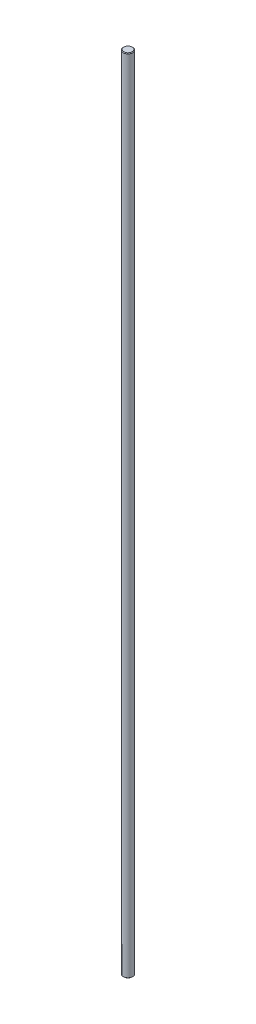
ISO-10303-21;
HEADER;
FILE_DESCRIPTION(('STEP AP214'),'2;1');
FILE_NAME('part.step','',(''),(''),'','','');
FILE_SCHEMA(('AUTOMOTIVE_DESIGN { 1 0 10303 214 1 1 1 1 }'));
ENDSEC;
DATA;
#1=APPLICATION_CONTEXT('core data for automotive mechanical design processes');
#2=APPLICATION_PROTOCOL_DEFINITION('international standard','automotive_design',2000,#1);
#3=PRODUCT_CONTEXT('',#1,'mechanical');
#4=PRODUCT('Part','Part','',(#3));
#5=PRODUCT_RELATED_PRODUCT_CATEGORY('part','',(#4));
#6=PRODUCT_DEFINITION_FORMATION('','',#4);
#7=PRODUCT_DEFINITION_CONTEXT('part definition',#1,'design');
#8=PRODUCT_DEFINITION('design','',#6,#7);
#9=PRODUCT_DEFINITION_SHAPE('','',#8);
#10=(LENGTH_UNIT() NAMED_UNIT(*) SI_UNIT(.MILLI.,.METRE.));
#11=(NAMED_UNIT(*) PLANE_ANGLE_UNIT() SI_UNIT($,.RADIAN.));
#12=(NAMED_UNIT(*) SI_UNIT($,.STERADIAN.) SOLID_ANGLE_UNIT());
#13=UNCERTAINTY_MEASURE_WITH_UNIT(LENGTH_MEASURE(1.E-05),#10,'distance_accuracy_value','');
#14=(GEOMETRIC_REPRESENTATION_CONTEXT(3) GLOBAL_UNCERTAINTY_ASSIGNED_CONTEXT((#13)) GLOBAL_UNIT_ASSIGNED_CONTEXT((#10,
#11,#12)) REPRESENTATION_CONTEXT('',''));
#15=CARTESIAN_POINT('',(0.,0.,0.));
#16=DIRECTION('',(0.,0.,1.));
#17=DIRECTION('',(1.,0.,0.));
#18=AXIS2_PLACEMENT_3D('',#15,#16,#17);
#19=CARTESIAN_POINT('',(0.,675.,0.));
#20=DIRECTION('',(0.,-1.,0.));
#21=DIRECTION('',(0.,0.,-1.));
#22=AXIS2_PLACEMENT_3D('',#19,#20,#21);
#23=CYLINDRICAL_SURFACE('',#22,4.);
#24=CARTESIAN_POINT('',(0.,0.500000000000056,0.));
#25=DIRECTION('',(0.,1.,0.));
#26=DIRECTION('',(0.,0.,1.));
#27=AXIS2_PLACEMENT_3D('',#24,#25,#26);
#28=CIRCLE('',#27,4.);
#29=CARTESIAN_POINT('',(0.,0.500000000000056,4.));
#30=VERTEX_POINT('',#29);
#31=EDGE_CURVE('E46',#30,#30,#28,.T.);
#32=ORIENTED_EDGE('',*,*,#31,.T.);
#33=EDGE_LOOP('',(#32));
#34=FACE_BOUND('',#33,.T.);
#35=CARTESIAN_POINT('',(0.,674.5,0.));
#36=DIRECTION('',(0.,1.,0.));
#37=DIRECTION('',(0.,0.,1.));
#38=AXIS2_PLACEMENT_3D('',#35,#36,#37);
#39=CIRCLE('',#38,4.);
#40=CARTESIAN_POINT('',(0.,674.5,4.));
#41=VERTEX_POINT('',#40);
#42=EDGE_CURVE('E50',#41,#41,#39,.F.);
#43=ORIENTED_EDGE('',*,*,#42,.T.);
#44=EDGE_LOOP('',(#43));
#45=FACE_BOUND('',#44,.T.);
#46=ADVANCED_FACE('F35',(#34,#45),#23,.T.);
#47=CARTESIAN_POINT('',(0.,675.,0.));
#48=DIRECTION('',(0.,1.,0.));
#49=DIRECTION('',(0.,0.,1.));
#50=AXIS2_PLACEMENT_3D('',#47,#48,#49);
#51=PLANE('',#50);
#52=CARTESIAN_POINT('',(0.,675.,0.));
#53=DIRECTION('',(0.,1.,0.));
#54=DIRECTION('',(0.,0.,1.));
#55=AXIS2_PLACEMENT_3D('',#52,#53,#54);
#56=CIRCLE('',#55,3.5);
#57=CARTESIAN_POINT('',(0.,675.,3.5));
#58=VERTEX_POINT('',#57);
#59=EDGE_CURVE('E10',#58,#58,#56,.T.);
#60=ORIENTED_EDGE('',*,*,#59,.T.);
#61=EDGE_LOOP('',(#60));
#62=FACE_BOUND('',#61,.T.);
#63=ADVANCED_FACE('F66',(#62),#51,.T.);
#64=CARTESIAN_POINT('',(0.,0.,0.));
#65=DIRECTION('',(0.,1.,0.));
#66=DIRECTION('',(0.,0.,1.));
#67=AXIS2_PLACEMENT_3D('',#64,#65,#66);
#68=PLANE('',#67);
#69=CARTESIAN_POINT('',(0.,0.,0.));
#70=DIRECTION('',(0.,1.,0.));
#71=DIRECTION('',(0.,0.,1.));
#72=AXIS2_PLACEMENT_3D('',#69,#70,#71);
#73=CIRCLE('',#72,3.49999999999989);
#74=CARTESIAN_POINT('',(0.,0.,3.49999999999989));
#75=VERTEX_POINT('',#74);
#76=EDGE_CURVE('E42',#75,#75,#73,.F.);
#77=ORIENTED_EDGE('',*,*,#76,.T.);
#78=EDGE_LOOP('',(#77));
#79=FACE_BOUND('',#78,.T.);
#80=ADVANCED_FACE('F63',(#79),#68,.F.);
#81=CARTESIAN_POINT('',(0.,0.500000000000056,0.));
#82=DIRECTION('',(0.,1.,0.));
#83=DIRECTION('',(0.,0.,1.));
#84=AXIS2_PLACEMENT_3D('',#81,#82,#83);
#85=CONICAL_SURFACE('',#84,4.,0.7853981633975);
#86=ORIENTED_EDGE('',*,*,#76,.F.);
#87=EDGE_LOOP('',(#86));
#88=FACE_BOUND('',#87,.T.);
#89=ORIENTED_EDGE('',*,*,#31,.F.);
#90=EDGE_LOOP('',(#89));
#91=FACE_BOUND('',#90,.T.);
#92=ADVANCED_FACE('F59',(#88,#91),#85,.T.);
#93=CARTESIAN_POINT('',(0.,675.,0.));
#94=DIRECTION('',(0.,-1.,0.));
#95=DIRECTION('',(0.,0.,-1.));
#96=AXIS2_PLACEMENT_3D('',#93,#94,#95);
#97=CONICAL_SURFACE('',#96,3.5,0.7853981633975);
#98=ORIENTED_EDGE('',*,*,#42,.F.);
#99=EDGE_LOOP('',(#98));
#100=FACE_BOUND('',#99,.T.);
#101=ORIENTED_EDGE('',*,*,#59,.F.);
#102=EDGE_LOOP('',(#101));
#103=FACE_BOUND('',#102,.T.);
#104=ADVANCED_FACE('F37',(#100,#103),#97,.T.);
#105=CLOSED_SHELL('',(#46,#63,#80,#92,#104));
#106=MANIFOLD_SOLID_BREP('B2',#105);
#107=ADVANCED_BREP_SHAPE_REPRESENTATION('',(#18,#106),#14);
#108=SHAPE_DEFINITION_REPRESENTATION(#9,#107);
ENDSEC;
END-ISO-10303-21;
